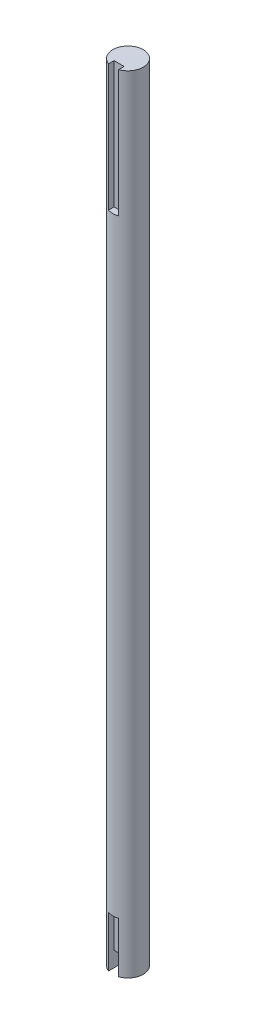
ISO-10303-21;
HEADER;
FILE_DESCRIPTION(('STEP AP214'),'2;1');
FILE_NAME('part.step','',(''),(''),'','','');
FILE_SCHEMA(('AUTOMOTIVE_DESIGN { 1 0 10303 214 1 1 1 1 }'));
ENDSEC;
DATA;
#1=APPLICATION_CONTEXT('core data for automotive mechanical design processes');
#2=APPLICATION_PROTOCOL_DEFINITION('international standard','automotive_design',2000,#1);
#3=PRODUCT_CONTEXT('',#1,'mechanical');
#4=PRODUCT('Part','Part','',(#3));
#5=PRODUCT_RELATED_PRODUCT_CATEGORY('part','',(#4));
#6=PRODUCT_DEFINITION_FORMATION('','',#4);
#7=PRODUCT_DEFINITION_CONTEXT('part definition',#1,'design');
#8=PRODUCT_DEFINITION('design','',#6,#7);
#9=PRODUCT_DEFINITION_SHAPE('','',#8);
#10=(LENGTH_UNIT() NAMED_UNIT(*) SI_UNIT(.MILLI.,.METRE.));
#11=(NAMED_UNIT(*) PLANE_ANGLE_UNIT() SI_UNIT($,.RADIAN.));
#12=(NAMED_UNIT(*) SI_UNIT($,.STERADIAN.) SOLID_ANGLE_UNIT());
#13=UNCERTAINTY_MEASURE_WITH_UNIT(LENGTH_MEASURE(1.E-05),#10,'distance_accuracy_value','');
#14=(GEOMETRIC_REPRESENTATION_CONTEXT(3) GLOBAL_UNCERTAINTY_ASSIGNED_CONTEXT((#13)) GLOBAL_UNIT_ASSIGNED_CONTEXT((#10,
#11,#12)) REPRESENTATION_CONTEXT('',''));
#15=CARTESIAN_POINT('',(0.,0.,0.));
#16=DIRECTION('',(0.,0.,1.));
#17=DIRECTION('',(1.,0.,0.));
#18=AXIS2_PLACEMENT_3D('',#15,#16,#17);
#19=CARTESIAN_POINT('',(0.,-56.,0.));
#20=DIRECTION('',(0.,1.,0.));
#21=DIRECTION('',(0.,0.,1.));
#22=AXIS2_PLACEMENT_3D('',#19,#20,#21);
#23=PLANE('',#22);
#24=DIRECTION('',(0.,0.,1.));
#25=VECTOR('',#24,1.);
#26=CARTESIAN_POINT('',(2.,-56.,0.));
#27=LINE('',#26,#25);
#28=CARTESIAN_POINT('',(2.,-56.,1.));
#29=VERTEX_POINT('',#28);
#30=CARTESIAN_POINT('',(2.,-56.,5.65685424949238));
#31=VERTEX_POINT('',#30);
#32=EDGE_CURVE('E186',#29,#31,#27,.T.);
#33=ORIENTED_EDGE('',*,*,#32,.F.);
#34=DIRECTION('',(-1.,0.,0.));
#35=VECTOR('',#34,1.);
#36=CARTESIAN_POINT('',(0.,-56.,1.));
#37=LINE('',#36,#35);
#38=CARTESIAN_POINT('',(-2.,-56.,0.999999999999999));
#39=VERTEX_POINT('',#38);
#40=EDGE_CURVE('E123',#29,#39,#37,.T.);
#41=ORIENTED_EDGE('',*,*,#40,.T.);
#42=DIRECTION('',(0.,0.,-1.));
#43=VECTOR('',#42,1.);
#44=CARTESIAN_POINT('',(-2.,-56.,0.));
#45=LINE('',#44,#43);
#46=CARTESIAN_POINT('',(-2.,-56.,5.65685424949238));
#47=VERTEX_POINT('',#46);
#48=EDGE_CURVE('E184',#47,#39,#45,.T.);
#49=ORIENTED_EDGE('',*,*,#48,.F.);
#50=CARTESIAN_POINT('',(0.,-56.,0.));
#51=DIRECTION('',(0.,1.,0.));
#52=DIRECTION('',(0.,0.,1.));
#53=AXIS2_PLACEMENT_3D('',#50,#51,#52);
#54=CIRCLE('',#53,6.);
#55=EDGE_CURVE('E181',#31,#47,#54,.T.);
#56=ORIENTED_EDGE('',*,*,#55,.F.);
#57=EDGE_LOOP('',(#33,#41,#49,#56));
#58=FACE_BOUND('',#57,.T.);
#59=ADVANCED_FACE('F38',(#58),#23,.F.);
#60=CARTESIAN_POINT('',(0.,-56.,0.));
#61=DIRECTION('',(0.,1.,0.));
#62=DIRECTION('',(0.,0.,1.));
#63=AXIS2_PLACEMENT_3D('',#60,#61,#62);
#64=CYLINDRICAL_SURFACE('',#63,6.);
#65=CARTESIAN_POINT('',(0.,-36.,0.));
#66=DIRECTION('',(0.,1.,0.));
#67=DIRECTION('',(0.,0.,1.));
#68=AXIS2_PLACEMENT_3D('',#65,#66,#67);
#69=CIRCLE('',#68,6.);
#70=CARTESIAN_POINT('',(2.,-36.,5.65685424949238));
#71=VERTEX_POINT('',#70);
#72=CARTESIAN_POINT('',(-2.,-36.,5.65685424949238));
#73=VERTEX_POINT('',#72);
#74=EDGE_CURVE('E188',#71,#73,#69,.F.);
#75=ORIENTED_EDGE('',*,*,#74,.F.);
#76=DIRECTION('',(0.,1.,0.));
#77=VECTOR('',#76,1.);
#78=CARTESIAN_POINT('',(2.,-56.,5.65685424949238));
#79=LINE('',#78,#77);
#80=EDGE_CURVE('E176',#71,#31,#79,.F.);
#81=ORIENTED_EDGE('',*,*,#80,.T.);
#82=ORIENTED_EDGE('',*,*,#55,.T.);
#83=DIRECTION('',(0.,1.,0.));
#84=VECTOR('',#83,1.);
#85=CARTESIAN_POINT('',(-2.,-56.,5.65685424949238));
#86=LINE('',#85,#84);
#87=EDGE_CURVE('E174',#47,#73,#86,.T.);
#88=ORIENTED_EDGE('',*,*,#87,.T.);
#89=EDGE_LOOP('',(#75,#81,#82,#88));
#90=FACE_BOUND('',#89,.T.);
#91=CARTESIAN_POINT('',(0.,204.,0.));
#92=DIRECTION('',(0.,-1.,0.));
#93=DIRECTION('',(0.,0.,-1.));
#94=AXIS2_PLACEMENT_3D('',#91,#92,#93);
#95=CIRCLE('',#94,6.);
#96=CARTESIAN_POINT('',(-2.,204.,5.65685424949238));
#97=VERTEX_POINT('',#96);
#98=CARTESIAN_POINT('',(2.,204.,5.65685424949238));
#99=VERTEX_POINT('',#98);
#100=EDGE_CURVE('E11',#97,#99,#95,.F.);
#101=ORIENTED_EDGE('',*,*,#100,.F.);
#102=DIRECTION('',(0.,1.,0.));
#103=VECTOR('',#102,1.);
#104=CARTESIAN_POINT('',(-2.,-56.,5.65685424949238));
#105=LINE('',#104,#103);
#106=CARTESIAN_POINT('',(-2.,254.,5.65685424949238));
#107=VERTEX_POINT('',#106);
#108=EDGE_CURVE('E160',#97,#107,#105,.T.);
#109=ORIENTED_EDGE('',*,*,#108,.T.);
#110=CARTESIAN_POINT('',(0.,254.,0.));
#111=DIRECTION('',(0.,1.,0.));
#112=DIRECTION('',(0.,0.,1.));
#113=AXIS2_PLACEMENT_3D('',#110,#111,#112);
#114=CIRCLE('',#113,6.);
#115=CARTESIAN_POINT('',(2.,254.,5.65685424949238));
#116=VERTEX_POINT('',#115);
#117=EDGE_CURVE('E178',#116,#107,#114,.T.);
#118=ORIENTED_EDGE('',*,*,#117,.F.);
#119=DIRECTION('',(0.,1.,0.));
#120=VECTOR('',#119,1.);
#121=CARTESIAN_POINT('',(2.,-56.,5.65685424949238));
#122=LINE('',#121,#120);
#123=EDGE_CURVE('E61',#116,#99,#122,.F.);
#124=ORIENTED_EDGE('',*,*,#123,.T.);
#125=EDGE_LOOP('',(#101,#109,#118,#124));
#126=FACE_BOUND('',#125,.T.);
#127=ADVANCED_FACE('F40',(#90,#126),#64,.T.);
#128=CARTESIAN_POINT('',(0.,254.,0.));
#129=DIRECTION('',(0.,1.,0.));
#130=DIRECTION('',(0.,0.,1.));
#131=AXIS2_PLACEMENT_3D('',#128,#129,#130);
#132=PLANE('',#131);
#133=ORIENTED_EDGE('',*,*,#117,.T.);
#134=DIRECTION('',(0.,0.,-1.));
#135=VECTOR('',#134,1.);
#136=CARTESIAN_POINT('',(-2.,254.,0.));
#137=LINE('',#136,#135);
#138=CARTESIAN_POINT('',(-2.,254.,3.5));
#139=VERTEX_POINT('',#138);
#140=EDGE_CURVE('E46',#107,#139,#137,.T.);
#141=ORIENTED_EDGE('',*,*,#140,.T.);
#142=DIRECTION('',(1.,0.,0.));
#143=VECTOR('',#142,1.);
#144=CARTESIAN_POINT('',(0.,254.,3.5));
#145=LINE('',#144,#143);
#146=CARTESIAN_POINT('',(2.,254.,3.5));
#147=VERTEX_POINT('',#146);
#148=EDGE_CURVE('E139',#139,#147,#145,.T.);
#149=ORIENTED_EDGE('',*,*,#148,.T.);
#150=DIRECTION('',(0.,0.,1.));
#151=VECTOR('',#150,1.);
#152=CARTESIAN_POINT('',(2.,254.,0.));
#153=LINE('',#152,#151);
#154=EDGE_CURVE('E147',#147,#116,#153,.T.);
#155=ORIENTED_EDGE('',*,*,#154,.T.);
#156=EDGE_LOOP('',(#133,#141,#149,#155));
#157=FACE_BOUND('',#156,.T.);
#158=ADVANCED_FACE('F192',(#157),#132,.T.);
#159=CARTESIAN_POINT('',(0.,-36.,3.5));
#160=DIRECTION('',(0.,0.,1.));
#161=DIRECTION('',(1.,0.,0.));
#162=AXIS2_PLACEMENT_3D('',#159,#160,#161);
#163=PLANE('',#162);
#164=DIRECTION('',(-1.,0.,0.));
#165=VECTOR('',#164,1.);
#166=CARTESIAN_POINT('',(0.,-50.,3.5));
#167=LINE('',#166,#165);
#168=CARTESIAN_POINT('',(2.,-50.,3.5));
#169=VERTEX_POINT('',#168);
#170=CARTESIAN_POINT('',(-2.,-50.,3.5));
#171=VERTEX_POINT('',#170);
#172=EDGE_CURVE('E136',#169,#171,#167,.T.);
#173=ORIENTED_EDGE('',*,*,#172,.F.);
#174=DIRECTION('',(0.,-1.,0.));
#175=VECTOR('',#174,1.);
#176=CARTESIAN_POINT('',(2.,-36.,3.5));
#177=LINE('',#176,#175);
#178=CARTESIAN_POINT('',(2.,-36.,3.5));
#179=VERTEX_POINT('',#178);
#180=EDGE_CURVE('E121',#179,#169,#177,.T.);
#181=ORIENTED_EDGE('',*,*,#180,.F.);
#182=DIRECTION('',(-1.,0.,0.));
#183=VECTOR('',#182,1.);
#184=CARTESIAN_POINT('',(0.,-36.,3.5));
#185=LINE('',#184,#183);
#186=CARTESIAN_POINT('',(-2.,-36.,3.5));
#187=VERTEX_POINT('',#186);
#188=EDGE_CURVE('E165',#179,#187,#185,.T.);
#189=ORIENTED_EDGE('',*,*,#188,.T.);
#190=DIRECTION('',(0.,-1.,0.));
#191=VECTOR('',#190,1.);
#192=CARTESIAN_POINT('',(-2.,-36.,3.5));
#193=LINE('',#192,#191);
#194=EDGE_CURVE('E170',#187,#171,#193,.T.);
#195=ORIENTED_EDGE('',*,*,#194,.T.);
#196=EDGE_LOOP('',(#173,#181,#189,#195));
#197=FACE_BOUND('',#196,.T.);
#198=ADVANCED_FACE('F226',(#197),#163,.T.);
#199=CARTESIAN_POINT('',(2.,-36.,0.));
#200=DIRECTION('',(-1.,0.,0.));
#201=DIRECTION('',(0.,0.,1.));
#202=AXIS2_PLACEMENT_3D('',#199,#200,#201);
#203=PLANE('',#202);
#204=ORIENTED_EDGE('',*,*,#180,.T.);
#205=DIRECTION('',(0.,0.,-1.));
#206=VECTOR('',#205,1.);
#207=CARTESIAN_POINT('',(2.,-50.,0.));
#208=LINE('',#207,#206);
#209=CARTESIAN_POINT('',(2.,-50.,1.));
#210=VERTEX_POINT('',#209);
#211=EDGE_CURVE('E53',#169,#210,#208,.T.);
#212=ORIENTED_EDGE('',*,*,#211,.T.);
#213=DIRECTION('',(0.,-1.,0.));
#214=VECTOR('',#213,1.);
#215=CARTESIAN_POINT('',(2.,-50.,1.));
#216=LINE('',#215,#214);
#217=EDGE_CURVE('E119',#210,#29,#216,.T.);
#218=ORIENTED_EDGE('',*,*,#217,.T.);
#219=ORIENTED_EDGE('',*,*,#32,.T.);
#220=ORIENTED_EDGE('',*,*,#80,.F.);
#221=DIRECTION('',(0.,0.,-1.));
#222=VECTOR('',#221,1.);
#223=CARTESIAN_POINT('',(2.,-36.,0.));
#224=LINE('',#223,#222);
#225=EDGE_CURVE('E163',#71,#179,#224,.T.);
#226=ORIENTED_EDGE('',*,*,#225,.T.);
#227=EDGE_LOOP('',(#204,#212,#218,#219,#220,#226));
#228=FACE_BOUND('',#227,.T.);
#229=ADVANCED_FACE('F116',(#228),#203,.T.);
#230=CARTESIAN_POINT('',(-2.,-36.,0.));
#231=DIRECTION('',(1.,0.,0.));
#232=DIRECTION('',(0.,0.,-1.));
#233=AXIS2_PLACEMENT_3D('',#230,#231,#232);
#234=PLANE('',#233);
#235=DIRECTION('',(0.,0.,1.));
#236=VECTOR('',#235,1.);
#237=CARTESIAN_POINT('',(-2.,-36.,0.));
#238=LINE('',#237,#236);
#239=EDGE_CURVE('E167',#187,#73,#238,.T.);
#240=ORIENTED_EDGE('',*,*,#239,.T.);
#241=ORIENTED_EDGE('',*,*,#87,.F.);
#242=ORIENTED_EDGE('',*,*,#48,.T.);
#243=DIRECTION('',(0.,-1.,0.));
#244=VECTOR('',#243,1.);
#245=CARTESIAN_POINT('',(-2.,-50.,0.999999999999999));
#246=LINE('',#245,#244);
#247=CARTESIAN_POINT('',(-2.,-50.,0.999999999999999));
#248=VERTEX_POINT('',#247);
#249=EDGE_CURVE('E137',#248,#39,#246,.T.);
#250=ORIENTED_EDGE('',*,*,#249,.F.);
#251=DIRECTION('',(0.,0.,1.));
#252=VECTOR('',#251,1.);
#253=CARTESIAN_POINT('',(-2.,-50.,0.));
#254=LINE('',#253,#252);
#255=EDGE_CURVE('E128',#248,#171,#254,.T.);
#256=ORIENTED_EDGE('',*,*,#255,.T.);
#257=ORIENTED_EDGE('',*,*,#194,.F.);
#258=EDGE_LOOP('',(#240,#241,#242,#250,#256,#257));
#259=FACE_BOUND('',#258,.T.);
#260=ADVANCED_FACE('F229',(#259),#234,.T.);
#261=CARTESIAN_POINT('',(0.,-36.,0.));
#262=DIRECTION('',(0.,1.,0.));
#263=DIRECTION('',(0.,0.,1.));
#264=AXIS2_PLACEMENT_3D('',#261,#262,#263);
#265=PLANE('',#264);
#266=ORIENTED_EDGE('',*,*,#74,.T.);
#267=ORIENTED_EDGE('',*,*,#239,.F.);
#268=ORIENTED_EDGE('',*,*,#188,.F.);
#269=ORIENTED_EDGE('',*,*,#225,.F.);
#270=EDGE_LOOP('',(#266,#267,#268,#269));
#271=FACE_BOUND('',#270,.T.);
#272=ADVANCED_FACE('F215',(#271),#265,.F.);
#273=CARTESIAN_POINT('',(-2.,204.,0.));
#274=DIRECTION('',(1.,0.,0.));
#275=DIRECTION('',(0.,0.,-1.));
#276=AXIS2_PLACEMENT_3D('',#273,#274,#275);
#277=PLANE('',#276);
#278=DIRECTION('',(0.,0.,-1.));
#279=VECTOR('',#278,1.);
#280=CARTESIAN_POINT('',(-2.,204.,0.));
#281=LINE('',#280,#279);
#282=CARTESIAN_POINT('',(-2.,204.,3.5));
#283=VERTEX_POINT('',#282);
#284=EDGE_CURVE('E144',#97,#283,#281,.T.);
#285=ORIENTED_EDGE('',*,*,#284,.T.);
#286=DIRECTION('',(0.,1.,0.));
#287=VECTOR('',#286,1.);
#288=CARTESIAN_POINT('',(-2.,204.,3.5));
#289=LINE('',#288,#287);
#290=EDGE_CURVE('E156',#283,#139,#289,.T.);
#291=ORIENTED_EDGE('',*,*,#290,.T.);
#292=ORIENTED_EDGE('',*,*,#140,.F.);
#293=ORIENTED_EDGE('',*,*,#108,.F.);
#294=EDGE_LOOP('',(#285,#291,#292,#293));
#295=FACE_BOUND('',#294,.T.);
#296=ADVANCED_FACE('F195',(#295),#277,.T.);
#297=CARTESIAN_POINT('',(0.,204.,3.5));
#298=DIRECTION('',(0.,0.,1.));
#299=DIRECTION('',(1.,0.,0.));
#300=AXIS2_PLACEMENT_3D('',#297,#298,#299);
#301=PLANE('',#300);
#302=ORIENTED_EDGE('',*,*,#148,.F.);
#303=ORIENTED_EDGE('',*,*,#290,.F.);
#304=DIRECTION('',(1.,0.,0.));
#305=VECTOR('',#304,1.);
#306=CARTESIAN_POINT('',(0.,204.,3.5));
#307=LINE('',#306,#305);
#308=CARTESIAN_POINT('',(2.,204.,3.5));
#309=VERTEX_POINT('',#308);
#310=EDGE_CURVE('E146',#283,#309,#307,.T.);
#311=ORIENTED_EDGE('',*,*,#310,.T.);
#312=DIRECTION('',(0.,1.,0.));
#313=VECTOR('',#312,1.);
#314=CARTESIAN_POINT('',(2.,204.,3.5));
#315=LINE('',#314,#313);
#316=EDGE_CURVE('E151',#309,#147,#315,.T.);
#317=ORIENTED_EDGE('',*,*,#316,.T.);
#318=EDGE_LOOP('',(#302,#303,#311,#317));
#319=FACE_BOUND('',#318,.T.);
#320=ADVANCED_FACE('F207',(#319),#301,.T.);
#321=CARTESIAN_POINT('',(2.,204.,0.));
#322=DIRECTION('',(-1.,0.,0.));
#323=DIRECTION('',(0.,0.,1.));
#324=AXIS2_PLACEMENT_3D('',#321,#322,#323);
#325=PLANE('',#324);
#326=ORIENTED_EDGE('',*,*,#154,.F.);
#327=ORIENTED_EDGE('',*,*,#316,.F.);
#328=DIRECTION('',(0.,0.,1.));
#329=VECTOR('',#328,1.);
#330=CARTESIAN_POINT('',(2.,204.,0.));
#331=LINE('',#330,#329);
#332=EDGE_CURVE('E149',#309,#99,#331,.T.);
#333=ORIENTED_EDGE('',*,*,#332,.T.);
#334=ORIENTED_EDGE('',*,*,#123,.F.);
#335=EDGE_LOOP('',(#326,#327,#333,#334));
#336=FACE_BOUND('',#335,.T.);
#337=ADVANCED_FACE('F205',(#336),#325,.T.);
#338=CARTESIAN_POINT('',(0.,204.,0.));
#339=DIRECTION('',(0.,-1.,0.));
#340=DIRECTION('',(0.,0.,-1.));
#341=AXIS2_PLACEMENT_3D('',#338,#339,#340);
#342=PLANE('',#341);
#343=ORIENTED_EDGE('',*,*,#100,.T.);
#344=ORIENTED_EDGE('',*,*,#332,.F.);
#345=ORIENTED_EDGE('',*,*,#310,.F.);
#346=ORIENTED_EDGE('',*,*,#284,.F.);
#347=EDGE_LOOP('',(#343,#344,#345,#346));
#348=FACE_BOUND('',#347,.T.);
#349=ADVANCED_FACE('F202',(#348),#342,.F.);
#350=CARTESIAN_POINT('',(0.,-50.,1.));
#351=DIRECTION('',(0.,0.,1.));
#352=DIRECTION('',(1.,0.,0.));
#353=AXIS2_PLACEMENT_3D('',#350,#351,#352);
#354=PLANE('',#353);
#355=ORIENTED_EDGE('',*,*,#40,.F.);
#356=ORIENTED_EDGE('',*,*,#217,.F.);
#357=DIRECTION('',(-1.,0.,0.));
#358=VECTOR('',#357,1.);
#359=CARTESIAN_POINT('',(0.,-50.,1.));
#360=LINE('',#359,#358);
#361=EDGE_CURVE('E122',#210,#248,#360,.T.);
#362=ORIENTED_EDGE('',*,*,#361,.T.);
#363=ORIENTED_EDGE('',*,*,#249,.T.);
#364=EDGE_LOOP('',(#355,#356,#362,#363));
#365=FACE_BOUND('',#364,.T.);
#366=ADVANCED_FACE('F134',(#365),#354,.T.);
#367=CARTESIAN_POINT('',(0.,-50.,0.));
#368=DIRECTION('',(0.,1.,0.));
#369=DIRECTION('',(0.,0.,1.));
#370=AXIS2_PLACEMENT_3D('',#367,#368,#369);
#371=PLANE('',#370);
#372=ORIENTED_EDGE('',*,*,#172,.T.);
#373=ORIENTED_EDGE('',*,*,#255,.F.);
#374=ORIENTED_EDGE('',*,*,#361,.F.);
#375=ORIENTED_EDGE('',*,*,#211,.F.);
#376=EDGE_LOOP('',(#372,#373,#374,#375));
#377=FACE_BOUND('',#376,.T.);
#378=ADVANCED_FACE('F126',(#377),#371,.F.);
#379=CLOSED_SHELL('',(#59,#127,#158,#198,#229,#260,#272,#296,#320,#337,#349,#366,#378));
#380=MANIFOLD_SOLID_BREP('B2',#379);
#381=ADVANCED_BREP_SHAPE_REPRESENTATION('',(#18,#380),#14);
#382=SHAPE_DEFINITION_REPRESENTATION(#9,#381);
ENDSEC;
END-ISO-10303-21;
